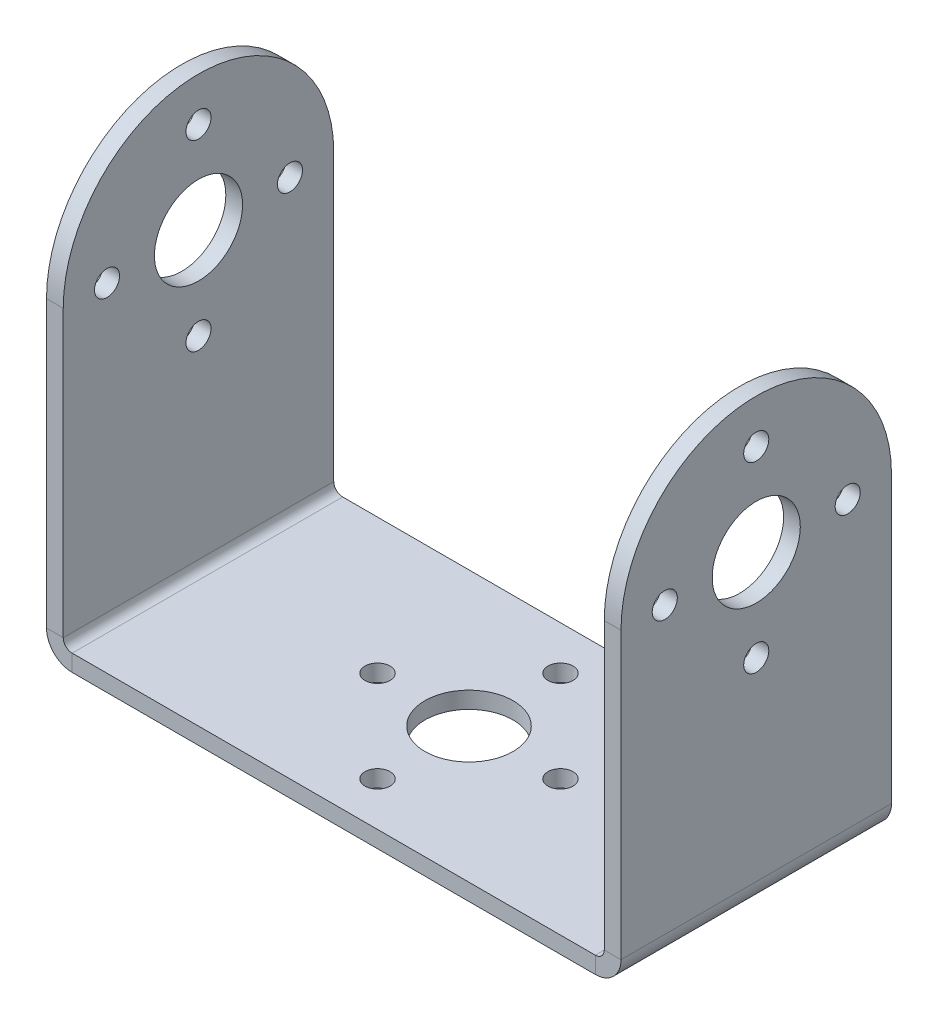
ISO-10303-21;
HEADER;
FILE_DESCRIPTION(('STEP AP214'),'2;1');
FILE_NAME('part.step','',(''),(''),'','','');
FILE_SCHEMA(('AUTOMOTIVE_DESIGN { 1 0 10303 214 1 1 1 1 }'));
ENDSEC;
DATA;
#1=APPLICATION_CONTEXT('core data for automotive mechanical design processes');
#2=APPLICATION_PROTOCOL_DEFINITION('international standard','automotive_design',2000,#1);
#3=PRODUCT_CONTEXT('',#1,'mechanical');
#4=PRODUCT('Part','Part','',(#3));
#5=PRODUCT_RELATED_PRODUCT_CATEGORY('part','',(#4));
#6=PRODUCT_DEFINITION_FORMATION('','',#4);
#7=PRODUCT_DEFINITION_CONTEXT('part definition',#1,'design');
#8=PRODUCT_DEFINITION('design','',#6,#7);
#9=PRODUCT_DEFINITION_SHAPE('','',#8);
#10=(LENGTH_UNIT() NAMED_UNIT(*) SI_UNIT(.MILLI.,.METRE.));
#11=(NAMED_UNIT(*) PLANE_ANGLE_UNIT() SI_UNIT($,.RADIAN.));
#12=(NAMED_UNIT(*) SI_UNIT($,.STERADIAN.) SOLID_ANGLE_UNIT());
#13=UNCERTAINTY_MEASURE_WITH_UNIT(LENGTH_MEASURE(1.E-05),#10,'distance_accuracy_value','');
#14=(GEOMETRIC_REPRESENTATION_CONTEXT(3) GLOBAL_UNCERTAINTY_ASSIGNED_CONTEXT((#13)) GLOBAL_UNIT_ASSIGNED_CONTEXT((#10,
#11,#12)) REPRESENTATION_CONTEXT('',''));
#15=CARTESIAN_POINT('',(0.,0.,0.));
#16=DIRECTION('',(0.,0.,1.));
#17=DIRECTION('',(1.,0.,0.));
#18=AXIS2_PLACEMENT_3D('',#15,#16,#17);
#19=CARTESIAN_POINT('',(26.162,28.321,0.));
#20=DIRECTION('',(1.,0.,0.));
#21=DIRECTION('',(0.,1.,0.));
#22=AXIS2_PLACEMENT_3D('',#19,#20,#21);
#23=CYLINDRICAL_SURFACE('',#22,12.319);
#24=DIRECTION('',(1.,0.,0.));
#25=VECTOR('',#24,1.);
#26=CARTESIAN_POINT('',(23.8251999999998,28.321,12.319));
#27=LINE('',#26,#25);
#28=CARTESIAN_POINT('',(26.162,28.321,12.319));
#29=VERTEX_POINT('',#28);
#30=CARTESIAN_POINT('',(24.638,28.321,12.319));
#31=VERTEX_POINT('',#30);
#32=EDGE_CURVE('E160',#29,#31,#27,.F.);
#33=ORIENTED_EDGE('',*,*,#32,.F.);
#34=CARTESIAN_POINT('',(26.162,28.321,0.));
#35=DIRECTION('',(-1.,0.,0.));
#36=DIRECTION('',(0.,0.,1.));
#37=AXIS2_PLACEMENT_3D('',#34,#35,#36);
#38=CIRCLE('',#37,12.319);
#39=CARTESIAN_POINT('',(26.162,28.321,-12.319));
#40=VERTEX_POINT('',#39);
#41=EDGE_CURVE('E50',#40,#29,#38,.F.);
#42=ORIENTED_EDGE('',*,*,#41,.F.);
#43=DIRECTION('',(1.,0.,0.));
#44=VECTOR('',#43,1.);
#45=CARTESIAN_POINT('',(23.8251999999998,28.321,-12.319));
#46=LINE('',#45,#44);
#47=CARTESIAN_POINT('',(24.638,28.321,-12.319));
#48=VERTEX_POINT('',#47);
#49=EDGE_CURVE('E292',#48,#40,#46,.T.);
#50=ORIENTED_EDGE('',*,*,#49,.F.);
#51=CARTESIAN_POINT('',(24.638,28.321,0.));
#52=DIRECTION('',(-1.,0.,0.));
#53=DIRECTION('',(0.,0.,1.));
#54=AXIS2_PLACEMENT_3D('',#51,#52,#53);
#55=CIRCLE('',#54,12.319);
#56=EDGE_CURVE('E11',#31,#48,#55,.T.);
#57=ORIENTED_EDGE('',*,*,#56,.F.);
#58=EDGE_LOOP('',(#33,#42,#50,#57));
#59=FACE_BOUND('',#58,.T.);
#60=ADVANCED_FACE('F42',(#59),#23,.T.);
#61=CARTESIAN_POINT('',(-24.638,28.321,0.));
#62=DIRECTION('',(1.,0.,0.));
#63=DIRECTION('',(0.,1.,0.));
#64=AXIS2_PLACEMENT_3D('',#61,#62,#63);
#65=CYLINDRICAL_SURFACE('',#64,12.319);
#66=DIRECTION('',(1.,0.,0.));
#67=VECTOR('',#66,1.);
#68=CARTESIAN_POINT('',(-23.8251999999998,28.321,12.319));
#69=LINE('',#68,#67);
#70=CARTESIAN_POINT('',(-24.638,28.321,12.319));
#71=VERTEX_POINT('',#70);
#72=CARTESIAN_POINT('',(-26.162,28.321,12.319));
#73=VERTEX_POINT('',#72);
#74=EDGE_CURVE('E276',#71,#73,#69,.F.);
#75=ORIENTED_EDGE('',*,*,#74,.F.);
#76=CARTESIAN_POINT('',(-24.638,28.321,0.));
#77=DIRECTION('',(1.,0.,0.));
#78=DIRECTION('',(0.,0.,-1.));
#79=AXIS2_PLACEMENT_3D('',#76,#77,#78);
#80=CIRCLE('',#79,12.319);
#81=CARTESIAN_POINT('',(-24.638,28.321,-12.319));
#82=VERTEX_POINT('',#81);
#83=EDGE_CURVE('E284',#82,#71,#80,.T.);
#84=ORIENTED_EDGE('',*,*,#83,.F.);
#85=DIRECTION('',(-1.,0.,0.));
#86=VECTOR('',#85,1.);
#87=CARTESIAN_POINT('',(-24.638,28.321,-12.319));
#88=LINE('',#87,#86);
#89=CARTESIAN_POINT('',(-26.162,28.321,-12.319));
#90=VERTEX_POINT('',#89);
#91=EDGE_CURVE('E280',#90,#82,#88,.F.);
#92=ORIENTED_EDGE('',*,*,#91,.F.);
#93=CARTESIAN_POINT('',(-26.162,28.321,0.));
#94=DIRECTION('',(1.,0.,0.));
#95=DIRECTION('',(0.,0.,-1.));
#96=AXIS2_PLACEMENT_3D('',#93,#94,#95);
#97=CIRCLE('',#96,12.319);
#98=EDGE_CURVE('E287',#73,#90,#97,.F.);
#99=ORIENTED_EDGE('',*,*,#98,.F.);
#100=EDGE_LOOP('',(#75,#84,#92,#99));
#101=FACE_BOUND('',#100,.T.);
#102=ADVANCED_FACE('F486',(#101),#65,.T.);
#103=CARTESIAN_POINT('',(-26.162,2.3368,12.319));
#104=DIRECTION('',(0.,0.,1.));
#105=DIRECTION('',(1.,0.,0.));
#106=AXIS2_PLACEMENT_3D('',#103,#104,#105);
#107=PLANE('',#106);
#108=DIRECTION('',(1.,0.,0.));
#109=VECTOR('',#108,1.);
#110=CARTESIAN_POINT('',(-26.162,2.3368,12.319));
#111=LINE('',#110,#109);
#112=CARTESIAN_POINT('',(-26.162,2.3368,12.319));
#113=VERTEX_POINT('',#112);
#114=CARTESIAN_POINT('',(-24.638,2.3368,12.319));
#115=VERTEX_POINT('',#114);
#116=EDGE_CURVE('E272',#113,#115,#111,.T.);
#117=ORIENTED_EDGE('',*,*,#116,.F.);
#118=CARTESIAN_POINT('',(-23.8252,2.3368,12.319));
#119=DIRECTION('',(0.,0.,-1.));
#120=DIRECTION('',(-1.,0.,0.));
#121=AXIS2_PLACEMENT_3D('',#118,#119,#120);
#122=CIRCLE('',#121,2.3368);
#123=CARTESIAN_POINT('',(-23.8252,0.,12.319));
#124=VERTEX_POINT('',#123);
#125=EDGE_CURVE('E184',#113,#124,#122,.F.);
#126=ORIENTED_EDGE('',*,*,#125,.T.);
#127=DIRECTION('',(0.,-1.,0.));
#128=VECTOR('',#127,1.);
#129=CARTESIAN_POINT('',(-23.8252,1.524,12.319));
#130=LINE('',#129,#128);
#131=CARTESIAN_POINT('',(-23.8252,1.524,12.319));
#132=VERTEX_POINT('',#131);
#133=EDGE_CURVE('E269',#132,#124,#130,.T.);
#134=ORIENTED_EDGE('',*,*,#133,.F.);
#135=CARTESIAN_POINT('',(-23.8252,2.3368,12.319));
#136=DIRECTION('',(0.,0.,1.));
#137=DIRECTION('',(1.,0.,0.));
#138=AXIS2_PLACEMENT_3D('',#135,#136,#137);
#139=CIRCLE('',#138,0.8128);
#140=EDGE_CURVE('E171',#115,#132,#139,.T.);
#141=ORIENTED_EDGE('',*,*,#140,.F.);
#142=EDGE_LOOP('',(#117,#126,#134,#141));
#143=FACE_BOUND('',#142,.T.);
#144=ADVANCED_FACE('F458',(#143),#107,.T.);
#145=CARTESIAN_POINT('',(-23.8252,1.524,12.319));
#146=DIRECTION('',(0.,0.,1.));
#147=DIRECTION('',(1.,0.,0.));
#148=AXIS2_PLACEMENT_3D('',#145,#146,#147);
#149=PLANE('',#148);
#150=DIRECTION('',(0.,1.,0.));
#151=VECTOR('',#150,1.);
#152=CARTESIAN_POINT('',(-24.638,0.,12.319));
#153=LINE('',#152,#151);
#154=EDGE_CURVE('E178',#71,#115,#153,.F.);
#155=ORIENTED_EDGE('',*,*,#154,.F.);
#156=ORIENTED_EDGE('',*,*,#74,.T.);
#157=DIRECTION('',(0.,-1.,0.));
#158=VECTOR('',#157,1.);
#159=CARTESIAN_POINT('',(-26.162,0.,12.319));
#160=LINE('',#159,#158);
#161=EDGE_CURVE('E181',#73,#113,#160,.T.);
#162=ORIENTED_EDGE('',*,*,#161,.T.);
#163=ORIENTED_EDGE('',*,*,#116,.T.);
#164=EDGE_LOOP('',(#155,#156,#162,#163));
#165=FACE_BOUND('',#164,.T.);
#166=ADVANCED_FACE('F483',(#165),#149,.T.);
#167=CARTESIAN_POINT('',(-23.8252,0.,-12.319));
#168=DIRECTION('',(0.,0.,-1.));
#169=DIRECTION('',(-1.,0.,0.));
#170=AXIS2_PLACEMENT_3D('',#167,#168,#169);
#171=PLANE('',#170);
#172=DIRECTION('',(0.,1.,0.));
#173=VECTOR('',#172,1.);
#174=CARTESIAN_POINT('',(-23.8252,0.,-12.319));
#175=LINE('',#174,#173);
#176=CARTESIAN_POINT('',(-23.8252,0.,-12.319));
#177=VERTEX_POINT('',#176);
#178=CARTESIAN_POINT('',(-23.8252,1.524,-12.319));
#179=VERTEX_POINT('',#178);
#180=EDGE_CURVE('E266',#177,#179,#175,.T.);
#181=ORIENTED_EDGE('',*,*,#180,.F.);
#182=CARTESIAN_POINT('',(-23.8252,2.3368,-12.319));
#183=DIRECTION('',(0.,0.,-1.));
#184=DIRECTION('',(-1.,0.,0.));
#185=AXIS2_PLACEMENT_3D('',#182,#183,#184);
#186=CIRCLE('',#185,2.3368);
#187=CARTESIAN_POINT('',(-26.162,2.3368,-12.319));
#188=VERTEX_POINT('',#187);
#189=EDGE_CURVE('E219',#188,#177,#186,.F.);
#190=ORIENTED_EDGE('',*,*,#189,.F.);
#191=DIRECTION('',(-1.,0.,0.));
#192=VECTOR('',#191,1.);
#193=CARTESIAN_POINT('',(-24.638,2.3368,-12.319));
#194=LINE('',#193,#192);
#195=CARTESIAN_POINT('',(-24.638,2.3368,-12.319));
#196=VERTEX_POINT('',#195);
#197=EDGE_CURVE('E262',#196,#188,#194,.T.);
#198=ORIENTED_EDGE('',*,*,#197,.F.);
#199=CARTESIAN_POINT('',(-23.8252,2.3368,-12.319));
#200=DIRECTION('',(0.,0.,1.));
#201=DIRECTION('',(1.,0.,0.));
#202=AXIS2_PLACEMENT_3D('',#199,#200,#201);
#203=CIRCLE('',#202,0.8128);
#204=EDGE_CURVE('E209',#196,#179,#203,.T.);
#205=ORIENTED_EDGE('',*,*,#204,.T.);
#206=EDGE_LOOP('',(#181,#190,#198,#205));
#207=FACE_BOUND('',#206,.T.);
#208=ADVANCED_FACE('F451',(#207),#171,.T.);
#209=CARTESIAN_POINT('',(-24.638,2.3368,-12.319));
#210=DIRECTION('',(0.,0.,-1.));
#211=DIRECTION('',(-1.,0.,0.));
#212=AXIS2_PLACEMENT_3D('',#209,#210,#211);
#213=PLANE('',#212);
#214=DIRECTION('',(1.,0.,0.));
#215=VECTOR('',#214,1.);
#216=CARTESIAN_POINT('',(-26.162,0.,-12.319));
#217=LINE('',#216,#215);
#218=CARTESIAN_POINT('',(23.8252,0.,-12.319));
#219=VERTEX_POINT('',#218);
#220=EDGE_CURVE('E223',#177,#219,#217,.T.);
#221=ORIENTED_EDGE('',*,*,#220,.F.);
#222=ORIENTED_EDGE('',*,*,#180,.T.);
#223=DIRECTION('',(1.,0.,0.));
#224=VECTOR('',#223,1.);
#225=CARTESIAN_POINT('',(-26.162,1.524,-12.319));
#226=LINE('',#225,#224);
#227=CARTESIAN_POINT('',(23.8252,1.524,-12.319));
#228=VERTEX_POINT('',#227);
#229=EDGE_CURVE('E205',#179,#228,#226,.T.);
#230=ORIENTED_EDGE('',*,*,#229,.T.);
#231=DIRECTION('',(0.,-1.,0.));
#232=VECTOR('',#231,1.);
#233=CARTESIAN_POINT('',(23.8252,1.524,-12.319));
#234=LINE('',#233,#232);
#235=EDGE_CURVE('E155',#228,#219,#234,.T.);
#236=ORIENTED_EDGE('',*,*,#235,.T.);
#237=EDGE_LOOP('',(#221,#222,#230,#236));
#238=FACE_BOUND('',#237,.T.);
#239=ADVANCED_FACE('F475',(#238),#213,.T.);
#240=CARTESIAN_POINT('',(23.8252,0.,12.319));
#241=DIRECTION('',(0.,0.,1.));
#242=DIRECTION('',(1.,0.,0.));
#243=AXIS2_PLACEMENT_3D('',#240,#241,#242);
#244=PLANE('',#243);
#245=DIRECTION('',(0.,1.,0.));
#246=VECTOR('',#245,1.);
#247=CARTESIAN_POINT('',(23.8252,0.,12.319));
#248=LINE('',#247,#246);
#249=CARTESIAN_POINT('',(23.8252,0.,12.319));
#250=VERTEX_POINT('',#249);
#251=CARTESIAN_POINT('',(23.8252,1.524,12.319));
#252=VERTEX_POINT('',#251);
#253=EDGE_CURVE('E142',#250,#252,#248,.T.);
#254=ORIENTED_EDGE('',*,*,#253,.F.);
#255=CARTESIAN_POINT('',(23.8252,2.3368,12.319));
#256=DIRECTION('',(0.,0.,-1.));
#257=DIRECTION('',(-1.,0.,0.));
#258=AXIS2_PLACEMENT_3D('',#255,#256,#257);
#259=CIRCLE('',#258,2.3368);
#260=CARTESIAN_POINT('',(26.162,2.3368,12.319));
#261=VERTEX_POINT('',#260);
#262=EDGE_CURVE('E136',#250,#261,#259,.F.);
#263=ORIENTED_EDGE('',*,*,#262,.T.);
#264=DIRECTION('',(1.,0.,0.));
#265=VECTOR('',#264,1.);
#266=CARTESIAN_POINT('',(24.638,2.3368,12.319));
#267=LINE('',#266,#265);
#268=CARTESIAN_POINT('',(24.638,2.3368,12.319));
#269=VERTEX_POINT('',#268);
#270=EDGE_CURVE('E129',#269,#261,#267,.T.);
#271=ORIENTED_EDGE('',*,*,#270,.F.);
#272=CARTESIAN_POINT('',(23.8252,2.3368,12.319));
#273=DIRECTION('',(0.,0.,1.));
#274=DIRECTION('',(1.,0.,0.));
#275=AXIS2_PLACEMENT_3D('',#272,#273,#274);
#276=CIRCLE('',#275,0.8128);
#277=EDGE_CURVE('E133',#252,#269,#276,.T.);
#278=ORIENTED_EDGE('',*,*,#277,.F.);
#279=EDGE_LOOP('',(#254,#263,#271,#278));
#280=FACE_BOUND('',#279,.T.);
#281=ADVANCED_FACE('F131',(#280),#244,.T.);
#282=CARTESIAN_POINT('',(24.638,2.3368,12.319));
#283=DIRECTION('',(0.,0.,1.));
#284=DIRECTION('',(1.,0.,0.));
#285=AXIS2_PLACEMENT_3D('',#282,#283,#284);
#286=PLANE('',#285);
#287=DIRECTION('',(1.,0.,0.));
#288=VECTOR('',#287,1.);
#289=CARTESIAN_POINT('',(-26.162,0.,12.319));
#290=LINE('',#289,#288);
#291=EDGE_CURVE('E188',#124,#250,#290,.T.);
#292=ORIENTED_EDGE('',*,*,#291,.T.);
#293=ORIENTED_EDGE('',*,*,#253,.T.);
#294=DIRECTION('',(1.,0.,0.));
#295=VECTOR('',#294,1.);
#296=CARTESIAN_POINT('',(-26.162,1.524,12.319));
#297=LINE('',#296,#295);
#298=EDGE_CURVE('E168',#132,#252,#297,.T.);
#299=ORIENTED_EDGE('',*,*,#298,.F.);
#300=ORIENTED_EDGE('',*,*,#133,.T.);
#301=EDGE_LOOP('',(#292,#293,#299,#300));
#302=FACE_BOUND('',#301,.T.);
#303=ADVANCED_FACE('F463',(#302),#286,.T.);
#304=CARTESIAN_POINT('',(26.162,2.3368,-12.319));
#305=DIRECTION('',(0.,0.,-1.));
#306=DIRECTION('',(-1.,0.,0.));
#307=AXIS2_PLACEMENT_3D('',#304,#305,#306);
#308=PLANE('',#307);
#309=DIRECTION('',(-1.,0.,0.));
#310=VECTOR('',#309,1.);
#311=CARTESIAN_POINT('',(26.162,2.3368,-12.319));
#312=LINE('',#311,#310);
#313=CARTESIAN_POINT('',(26.162,2.3368,-12.319));
#314=VERTEX_POINT('',#313);
#315=CARTESIAN_POINT('',(24.638,2.3368,-12.319));
#316=VERTEX_POINT('',#315);
#317=EDGE_CURVE('E143',#314,#316,#312,.T.);
#318=ORIENTED_EDGE('',*,*,#317,.F.);
#319=CARTESIAN_POINT('',(23.8252,2.3368,-12.319));
#320=DIRECTION('',(0.,0.,-1.));
#321=DIRECTION('',(-1.,0.,0.));
#322=AXIS2_PLACEMENT_3D('',#319,#320,#321);
#323=CIRCLE('',#322,2.3368);
#324=EDGE_CURVE('E227',#219,#314,#323,.F.);
#325=ORIENTED_EDGE('',*,*,#324,.F.);
#326=ORIENTED_EDGE('',*,*,#235,.F.);
#327=CARTESIAN_POINT('',(23.8252,2.3368,-12.319));
#328=DIRECTION('',(0.,0.,1.));
#329=DIRECTION('',(1.,0.,0.));
#330=AXIS2_PLACEMENT_3D('',#327,#328,#329);
#331=CIRCLE('',#330,0.8128);
#332=EDGE_CURVE('E202',#228,#316,#331,.T.);
#333=ORIENTED_EDGE('',*,*,#332,.T.);
#334=EDGE_LOOP('',(#318,#325,#326,#333));
#335=FACE_BOUND('',#334,.T.);
#336=ADVANCED_FACE('F474',(#335),#308,.T.);
#337=CARTESIAN_POINT('',(23.8252,1.524,-12.319));
#338=DIRECTION('',(0.,0.,-1.));
#339=DIRECTION('',(-1.,0.,0.));
#340=AXIS2_PLACEMENT_3D('',#337,#338,#339);
#341=PLANE('',#340);
#342=DIRECTION('',(0.,1.,0.));
#343=VECTOR('',#342,1.);
#344=CARTESIAN_POINT('',(24.638,0.,-12.319));
#345=LINE('',#344,#343);
#346=EDGE_CURVE('E150',#316,#48,#345,.T.);
#347=ORIENTED_EDGE('',*,*,#346,.T.);
#348=ORIENTED_EDGE('',*,*,#49,.T.);
#349=DIRECTION('',(0.,1.,0.));
#350=VECTOR('',#349,1.);
#351=CARTESIAN_POINT('',(26.162,0.,-12.319));
#352=LINE('',#351,#350);
#353=EDGE_CURVE('E195',#314,#40,#352,.T.);
#354=ORIENTED_EDGE('',*,*,#353,.F.);
#355=ORIENTED_EDGE('',*,*,#317,.T.);
#356=EDGE_LOOP('',(#347,#348,#354,#355));
#357=FACE_BOUND('',#356,.T.);
#358=ADVANCED_FACE('F472',(#357),#341,.T.);
#359=CARTESIAN_POINT('',(26.162,0.,12.319));
#360=DIRECTION('',(-1.,0.,0.));
#361=DIRECTION('',(0.,0.,1.));
#362=AXIS2_PLACEMENT_3D('',#359,#360,#361);
#363=PLANE('',#362);
#364=CARTESIAN_POINT('',(26.162,28.321,8.3312));
#365=DIRECTION('',(1.,0.,0.));
#366=DIRECTION('',(0.,0.,-1.));
#367=AXIS2_PLACEMENT_3D('',#364,#365,#366);
#368=CIRCLE('',#367,1.143);
#369=CARTESIAN_POINT('',(26.162,28.321,7.1882));
#370=VERTEX_POINT('',#369);
#371=EDGE_CURVE('E373',#370,#370,#368,.T.);
#372=ORIENTED_EDGE('',*,*,#371,.F.);
#373=EDGE_LOOP('',(#372));
#374=FACE_BOUND('',#373,.T.);
#375=CARTESIAN_POINT('',(26.162,19.9898,0.));
#376=DIRECTION('',(1.,0.,0.));
#377=DIRECTION('',(0.,0.,-1.));
#378=AXIS2_PLACEMENT_3D('',#375,#376,#377);
#379=CIRCLE('',#378,1.143);
#380=CARTESIAN_POINT('',(26.162,19.9898,-1.143));
#381=VERTEX_POINT('',#380);
#382=EDGE_CURVE('E357',#381,#381,#379,.T.);
#383=ORIENTED_EDGE('',*,*,#382,.F.);
#384=EDGE_LOOP('',(#383));
#385=FACE_BOUND('',#384,.T.);
#386=CARTESIAN_POINT('',(26.162,28.321,-8.3312));
#387=DIRECTION('',(1.,0.,0.));
#388=DIRECTION('',(0.,0.,-1.));
#389=AXIS2_PLACEMENT_3D('',#386,#387,#388);
#390=CIRCLE('',#389,1.143);
#391=CARTESIAN_POINT('',(26.162,28.321,-9.4742));
#392=VERTEX_POINT('',#391);
#393=EDGE_CURVE('E341',#392,#392,#390,.T.);
#394=ORIENTED_EDGE('',*,*,#393,.F.);
#395=EDGE_LOOP('',(#394));
#396=FACE_BOUND('',#395,.T.);
#397=CARTESIAN_POINT('',(26.162,36.6522,0.));
#398=DIRECTION('',(1.,0.,0.));
#399=DIRECTION('',(0.,0.,-1.));
#400=AXIS2_PLACEMENT_3D('',#397,#398,#399);
#401=CIRCLE('',#400,1.143);
#402=CARTESIAN_POINT('',(26.162,36.6522,-1.143));
#403=VERTEX_POINT('',#402);
#404=EDGE_CURVE('E325',#403,#403,#401,.T.);
#405=ORIENTED_EDGE('',*,*,#404,.F.);
#406=EDGE_LOOP('',(#405));
#407=FACE_BOUND('',#406,.T.);
#408=CARTESIAN_POINT('',(26.162,28.321,0.));
#409=DIRECTION('',(1.,0.,0.));
#410=DIRECTION('',(0.,0.,-1.));
#411=AXIS2_PLACEMENT_3D('',#408,#409,#410);
#412=CIRCLE('',#411,4.0132);
#413=CARTESIAN_POINT('',(26.162,28.321,-4.0132));
#414=VERTEX_POINT('',#413);
#415=EDGE_CURVE('E309',#414,#414,#412,.T.);
#416=ORIENTED_EDGE('',*,*,#415,.F.);
#417=EDGE_LOOP('',(#416));
#418=FACE_BOUND('',#417,.T.);
#419=ORIENTED_EDGE('',*,*,#353,.T.);
#420=ORIENTED_EDGE('',*,*,#41,.T.);
#421=DIRECTION('',(0.,1.,0.));
#422=VECTOR('',#421,1.);
#423=CARTESIAN_POINT('',(26.162,0.,12.319));
#424=LINE('',#423,#422);
#425=EDGE_CURVE('E162',#261,#29,#424,.T.);
#426=ORIENTED_EDGE('',*,*,#425,.F.);
#427=DIRECTION('',(0.,0.,-1.));
#428=VECTOR('',#427,1.);
#429=CARTESIAN_POINT('',(26.162,2.3368,12.319));
#430=LINE('',#429,#428);
#431=EDGE_CURVE('E194',#261,#314,#430,.T.);
#432=ORIENTED_EDGE('',*,*,#431,.T.);
#433=EDGE_LOOP('',(#419,#420,#426,#432));
#434=FACE_BOUND('',#433,.T.);
#435=ADVANCED_FACE('F297',(#374,#385,#396,#407,#418,#434),#363,.F.);
#436=CARTESIAN_POINT('',(24.638,0.,12.319));
#437=DIRECTION('',(-1.,0.,0.));
#438=DIRECTION('',(0.,0.,1.));
#439=AXIS2_PLACEMENT_3D('',#436,#437,#438);
#440=PLANE('',#439);
#441=CARTESIAN_POINT('',(24.638,28.321,8.3312));
#442=DIRECTION('',(-1.,0.,0.));
#443=DIRECTION('',(0.,0.,1.));
#444=AXIS2_PLACEMENT_3D('',#441,#442,#443);
#445=CIRCLE('',#444,1.143);
#446=CARTESIAN_POINT('',(24.638,28.321,9.4742));
#447=VERTEX_POINT('',#446);
#448=EDGE_CURVE('E361',#447,#447,#445,.T.);
#449=ORIENTED_EDGE('',*,*,#448,.F.);
#450=EDGE_LOOP('',(#449));
#451=FACE_BOUND('',#450,.T.);
#452=CARTESIAN_POINT('',(24.638,19.9898,0.));
#453=DIRECTION('',(-1.,0.,0.));
#454=DIRECTION('',(0.,0.,1.));
#455=AXIS2_PLACEMENT_3D('',#452,#453,#454);
#456=CIRCLE('',#455,1.143);
#457=CARTESIAN_POINT('',(24.638,19.9898,1.143));
#458=VERTEX_POINT('',#457);
#459=EDGE_CURVE('E345',#458,#458,#456,.T.);
#460=ORIENTED_EDGE('',*,*,#459,.F.);
#461=EDGE_LOOP('',(#460));
#462=FACE_BOUND('',#461,.T.);
#463=CARTESIAN_POINT('',(24.638,28.321,-8.3312));
#464=DIRECTION('',(-1.,0.,0.));
#465=DIRECTION('',(0.,0.,1.));
#466=AXIS2_PLACEMENT_3D('',#463,#464,#465);
#467=CIRCLE('',#466,1.143);
#468=CARTESIAN_POINT('',(24.638,28.321,-7.1882));
#469=VERTEX_POINT('',#468);
#470=EDGE_CURVE('E329',#469,#469,#467,.T.);
#471=ORIENTED_EDGE('',*,*,#470,.F.);
#472=EDGE_LOOP('',(#471));
#473=FACE_BOUND('',#472,.T.);
#474=CARTESIAN_POINT('',(24.638,36.6522,0.));
#475=DIRECTION('',(-1.,0.,0.));
#476=DIRECTION('',(0.,0.,1.));
#477=AXIS2_PLACEMENT_3D('',#474,#475,#476);
#478=CIRCLE('',#477,1.143);
#479=CARTESIAN_POINT('',(24.638,36.6522,1.143));
#480=VERTEX_POINT('',#479);
#481=EDGE_CURVE('E313',#480,#480,#478,.T.);
#482=ORIENTED_EDGE('',*,*,#481,.F.);
#483=EDGE_LOOP('',(#482));
#484=FACE_BOUND('',#483,.T.);
#485=CARTESIAN_POINT('',(24.638,28.321,0.));
#486=DIRECTION('',(-1.,0.,0.));
#487=DIRECTION('',(0.,0.,1.));
#488=AXIS2_PLACEMENT_3D('',#485,#486,#487);
#489=CIRCLE('',#488,4.0132);
#490=CARTESIAN_POINT('',(24.638,28.321,4.0132));
#491=VERTEX_POINT('',#490);
#492=EDGE_CURVE('E199',#491,#491,#489,.T.);
#493=ORIENTED_EDGE('',*,*,#492,.F.);
#494=EDGE_LOOP('',(#493));
#495=FACE_BOUND('',#494,.T.);
#496=DIRECTION('',(0.,1.,0.));
#497=VECTOR('',#496,1.);
#498=CARTESIAN_POINT('',(24.638,0.,12.319));
#499=LINE('',#498,#497);
#500=EDGE_CURVE('E148',#269,#31,#499,.T.);
#501=ORIENTED_EDGE('',*,*,#500,.T.);
#502=ORIENTED_EDGE('',*,*,#56,.T.);
#503=ORIENTED_EDGE('',*,*,#346,.F.);
#504=DIRECTION('',(0.,0.,-1.));
#505=VECTOR('',#504,1.);
#506=CARTESIAN_POINT('',(24.638,2.3368,12.319));
#507=LINE('',#506,#505);
#508=EDGE_CURVE('E146',#269,#316,#507,.T.);
#509=ORIENTED_EDGE('',*,*,#508,.F.);
#510=EDGE_LOOP('',(#501,#502,#503,#509));
#511=FACE_BOUND('',#510,.T.);
#512=ADVANCED_FACE('F147',(#451,#462,#473,#484,#495,#511),#440,.T.);
#513=CARTESIAN_POINT('',(23.8252,2.3368,12.319));
#514=DIRECTION('',(0.,0.,-1.));
#515=DIRECTION('',(-1.,0.,0.));
#516=AXIS2_PLACEMENT_3D('',#513,#514,#515);
#517=CYLINDRICAL_SURFACE('',#516,0.8128);
#518=ORIENTED_EDGE('',*,*,#332,.F.);
#519=DIRECTION('',(0.,0.,-1.));
#520=VECTOR('',#519,1.);
#521=CARTESIAN_POINT('',(23.8252,1.524,12.319));
#522=LINE('',#521,#520);
#523=EDGE_CURVE('E156',#252,#228,#522,.T.);
#524=ORIENTED_EDGE('',*,*,#523,.F.);
#525=ORIENTED_EDGE('',*,*,#277,.T.);
#526=ORIENTED_EDGE('',*,*,#508,.T.);
#527=EDGE_LOOP('',(#518,#524,#525,#526));
#528=FACE_BOUND('',#527,.T.);
#529=ADVANCED_FACE('F165',(#528),#517,.F.);
#530=CARTESIAN_POINT('',(-26.162,1.524,12.319));
#531=DIRECTION('',(0.,1.,0.));
#532=DIRECTION('',(0.,0.,1.));
#533=AXIS2_PLACEMENT_3D('',#530,#531,#532);
#534=PLANE('',#533);
#535=CARTESIAN_POINT('',(-8.3312,1.524,0.));
#536=DIRECTION('',(0.,1.,0.));
#537=DIRECTION('',(0.,0.,1.));
#538=AXIS2_PLACEMENT_3D('',#535,#536,#537);
#539=CIRCLE('',#538,1.143);
#540=CARTESIAN_POINT('',(-8.3312,1.524,1.14299999999999));
#541=VERTEX_POINT('',#540);
#542=EDGE_CURVE('E413',#541,#541,#539,.T.);
#543=ORIENTED_EDGE('',*,*,#542,.F.);
#544=EDGE_LOOP('',(#543));
#545=FACE_BOUND('',#544,.T.);
#546=CARTESIAN_POINT('',(0.,1.524,8.3312));
#547=DIRECTION('',(0.,1.,0.));
#548=DIRECTION('',(0.,0.,1.));
#549=AXIS2_PLACEMENT_3D('',#546,#547,#548);
#550=CIRCLE('',#549,1.143);
#551=CARTESIAN_POINT('',(0.,1.524,9.4742));
#552=VERTEX_POINT('',#551);
#553=EDGE_CURVE('E405',#552,#552,#550,.T.);
#554=ORIENTED_EDGE('',*,*,#553,.F.);
#555=EDGE_LOOP('',(#554));
#556=FACE_BOUND('',#555,.T.);
#557=CARTESIAN_POINT('',(8.3312,1.524,0.));
#558=DIRECTION('',(0.,1.,0.));
#559=DIRECTION('',(0.,0.,1.));
#560=AXIS2_PLACEMENT_3D('',#557,#558,#559);
#561=CIRCLE('',#560,1.143);
#562=CARTESIAN_POINT('',(8.3312,1.524,1.143));
#563=VERTEX_POINT('',#562);
#564=EDGE_CURVE('E397',#563,#563,#561,.T.);
#565=ORIENTED_EDGE('',*,*,#564,.F.);
#566=EDGE_LOOP('',(#565));
#567=FACE_BOUND('',#566,.T.);
#568=CARTESIAN_POINT('',(0.,1.524,-8.3312));
#569=DIRECTION('',(0.,1.,0.));
#570=DIRECTION('',(0.,0.,1.));
#571=AXIS2_PLACEMENT_3D('',#568,#569,#570);
#572=CIRCLE('',#571,1.143);
#573=CARTESIAN_POINT('',(0.,1.524,-7.1882));
#574=VERTEX_POINT('',#573);
#575=EDGE_CURVE('E389',#574,#574,#572,.T.);
#576=ORIENTED_EDGE('',*,*,#575,.F.);
#577=EDGE_LOOP('',(#576));
#578=FACE_BOUND('',#577,.T.);
#579=CARTESIAN_POINT('',(0.,1.524,0.));
#580=DIRECTION('',(0.,1.,0.));
#581=DIRECTION('',(0.,0.,1.));
#582=AXIS2_PLACEMENT_3D('',#579,#580,#581);
#583=CIRCLE('',#582,4.0132);
#584=CARTESIAN_POINT('',(0.,1.524,4.0132));
#585=VERTEX_POINT('',#584);
#586=EDGE_CURVE('E381',#585,#585,#583,.T.);
#587=ORIENTED_EDGE('',*,*,#586,.F.);
#588=EDGE_LOOP('',(#587));
#589=FACE_BOUND('',#588,.T.);
#590=ORIENTED_EDGE('',*,*,#229,.F.);
#591=DIRECTION('',(0.,0.,-1.));
#592=VECTOR('',#591,1.);
#593=CARTESIAN_POINT('',(-23.8252,1.524,12.319));
#594=LINE('',#593,#592);
#595=EDGE_CURVE('E250',#132,#179,#594,.T.);
#596=ORIENTED_EDGE('',*,*,#595,.F.);
#597=ORIENTED_EDGE('',*,*,#298,.T.);
#598=ORIENTED_EDGE('',*,*,#523,.T.);
#599=EDGE_LOOP('',(#590,#596,#597,#598));
#600=FACE_BOUND('',#599,.T.);
#601=ADVANCED_FACE('F431',(#545,#556,#567,#578,#589,#600),#534,.T.);
#602=CARTESIAN_POINT('',(-23.8252,2.3368,12.319));
#603=DIRECTION('',(0.,0.,-1.));
#604=DIRECTION('',(-1.,0.,0.));
#605=AXIS2_PLACEMENT_3D('',#602,#603,#604);
#606=CYLINDRICAL_SURFACE('',#605,0.8128);
#607=ORIENTED_EDGE('',*,*,#204,.F.);
#608=DIRECTION('',(0.,0.,-1.));
#609=VECTOR('',#608,1.);
#610=CARTESIAN_POINT('',(-24.638,2.3368,12.319));
#611=LINE('',#610,#609);
#612=EDGE_CURVE('E246',#115,#196,#611,.T.);
#613=ORIENTED_EDGE('',*,*,#612,.F.);
#614=ORIENTED_EDGE('',*,*,#140,.T.);
#615=ORIENTED_EDGE('',*,*,#595,.T.);
#616=EDGE_LOOP('',(#607,#613,#614,#615));
#617=FACE_BOUND('',#616,.T.);
#618=ADVANCED_FACE('F434',(#617),#606,.F.);
#619=CARTESIAN_POINT('',(-24.638,0.,12.319));
#620=DIRECTION('',(1.,0.,0.));
#621=DIRECTION('',(0.,0.,-1.));
#622=AXIS2_PLACEMENT_3D('',#619,#620,#621);
#623=PLANE('',#622);
#624=CARTESIAN_POINT('',(-24.638,28.321,8.3312));
#625=DIRECTION('',(1.,0.,0.));
#626=DIRECTION('',(0.,0.,-1.));
#627=AXIS2_PLACEMENT_3D('',#624,#625,#626);
#628=CIRCLE('',#627,1.143);
#629=CARTESIAN_POINT('',(-24.638,28.321,7.1882));
#630=VERTEX_POINT('',#629);
#631=EDGE_CURVE('E368',#630,#630,#628,.T.);
#632=ORIENTED_EDGE('',*,*,#631,.F.);
#633=EDGE_LOOP('',(#632));
#634=FACE_BOUND('',#633,.T.);
#635=CARTESIAN_POINT('',(-24.638,19.9898,0.));
#636=DIRECTION('',(1.,0.,0.));
#637=DIRECTION('',(0.,0.,-1.));
#638=AXIS2_PLACEMENT_3D('',#635,#636,#637);
#639=CIRCLE('',#638,1.143);
#640=CARTESIAN_POINT('',(-24.638,19.9898,-1.143));
#641=VERTEX_POINT('',#640);
#642=EDGE_CURVE('E352',#641,#641,#639,.T.);
#643=ORIENTED_EDGE('',*,*,#642,.F.);
#644=EDGE_LOOP('',(#643));
#645=FACE_BOUND('',#644,.T.);
#646=CARTESIAN_POINT('',(-24.638,28.321,-8.3312));
#647=DIRECTION('',(1.,0.,0.));
#648=DIRECTION('',(0.,0.,-1.));
#649=AXIS2_PLACEMENT_3D('',#646,#647,#648);
#650=CIRCLE('',#649,1.143);
#651=CARTESIAN_POINT('',(-24.638,28.321,-9.4742));
#652=VERTEX_POINT('',#651);
#653=EDGE_CURVE('E336',#652,#652,#650,.T.);
#654=ORIENTED_EDGE('',*,*,#653,.F.);
#655=EDGE_LOOP('',(#654));
#656=FACE_BOUND('',#655,.T.);
#657=CARTESIAN_POINT('',(-24.638,36.6522,0.));
#658=DIRECTION('',(1.,0.,0.));
#659=DIRECTION('',(0.,0.,-1.));
#660=AXIS2_PLACEMENT_3D('',#657,#658,#659);
#661=CIRCLE('',#660,1.143);
#662=CARTESIAN_POINT('',(-24.638,36.6522,-1.143));
#663=VERTEX_POINT('',#662);
#664=EDGE_CURVE('E320',#663,#663,#661,.T.);
#665=ORIENTED_EDGE('',*,*,#664,.F.);
#666=EDGE_LOOP('',(#665));
#667=FACE_BOUND('',#666,.T.);
#668=CARTESIAN_POINT('',(-24.638,28.321,0.));
#669=DIRECTION('',(1.,0.,0.));
#670=DIRECTION('',(0.,0.,-1.));
#671=AXIS2_PLACEMENT_3D('',#668,#669,#670);
#672=CIRCLE('',#671,4.0132);
#673=CARTESIAN_POINT('',(-24.638,28.321,-4.0132));
#674=VERTEX_POINT('',#673);
#675=EDGE_CURVE('E304',#674,#674,#672,.T.);
#676=ORIENTED_EDGE('',*,*,#675,.F.);
#677=EDGE_LOOP('',(#676));
#678=FACE_BOUND('',#677,.T.);
#679=DIRECTION('',(0.,1.,0.));
#680=VECTOR('',#679,1.);
#681=CARTESIAN_POINT('',(-24.638,0.,-12.319));
#682=LINE('',#681,#680);
#683=EDGE_CURVE('E213',#82,#196,#682,.F.);
#684=ORIENTED_EDGE('',*,*,#683,.F.);
#685=ORIENTED_EDGE('',*,*,#83,.T.);
#686=ORIENTED_EDGE('',*,*,#154,.T.);
#687=ORIENTED_EDGE('',*,*,#612,.T.);
#688=EDGE_LOOP('',(#684,#685,#686,#687));
#689=FACE_BOUND('',#688,.T.);
#690=ADVANCED_FACE('F505',(#634,#645,#656,#667,#678,#689),#623,.T.);
#691=CARTESIAN_POINT('',(-26.162,0.,12.319));
#692=DIRECTION('',(1.,0.,0.));
#693=DIRECTION('',(0.,0.,-1.));
#694=AXIS2_PLACEMENT_3D('',#691,#692,#693);
#695=PLANE('',#694);
#696=CARTESIAN_POINT('',(-26.162,28.321,8.3312));
#697=DIRECTION('',(1.,0.,0.));
#698=DIRECTION('',(0.,0.,-1.));
#699=AXIS2_PLACEMENT_3D('',#696,#697,#698);
#700=CIRCLE('',#699,1.143);
#701=CARTESIAN_POINT('',(-26.162,28.321,7.1882));
#702=VERTEX_POINT('',#701);
#703=EDGE_CURVE('E372',#702,#702,#700,.T.);
#704=ORIENTED_EDGE('',*,*,#703,.T.);
#705=EDGE_LOOP('',(#704));
#706=FACE_BOUND('',#705,.T.);
#707=CARTESIAN_POINT('',(-26.162,19.9898,0.));
#708=DIRECTION('',(1.,0.,0.));
#709=DIRECTION('',(0.,0.,-1.));
#710=AXIS2_PLACEMENT_3D('',#707,#708,#709);
#711=CIRCLE('',#710,1.143);
#712=CARTESIAN_POINT('',(-26.162,19.9898,-1.143));
#713=VERTEX_POINT('',#712);
#714=EDGE_CURVE('E356',#713,#713,#711,.T.);
#715=ORIENTED_EDGE('',*,*,#714,.T.);
#716=EDGE_LOOP('',(#715));
#717=FACE_BOUND('',#716,.T.);
#718=CARTESIAN_POINT('',(-26.162,28.321,-8.3312));
#719=DIRECTION('',(1.,0.,0.));
#720=DIRECTION('',(0.,0.,-1.));
#721=AXIS2_PLACEMENT_3D('',#718,#719,#720);
#722=CIRCLE('',#721,1.143);
#723=CARTESIAN_POINT('',(-26.162,28.321,-9.4742));
#724=VERTEX_POINT('',#723);
#725=EDGE_CURVE('E340',#724,#724,#722,.T.);
#726=ORIENTED_EDGE('',*,*,#725,.T.);
#727=EDGE_LOOP('',(#726));
#728=FACE_BOUND('',#727,.T.);
#729=CARTESIAN_POINT('',(-26.162,36.6522,0.));
#730=DIRECTION('',(1.,0.,0.));
#731=DIRECTION('',(0.,0.,-1.));
#732=AXIS2_PLACEMENT_3D('',#729,#730,#731);
#733=CIRCLE('',#732,1.143);
#734=CARTESIAN_POINT('',(-26.162,36.6522,-1.143));
#735=VERTEX_POINT('',#734);
#736=EDGE_CURVE('E324',#735,#735,#733,.T.);
#737=ORIENTED_EDGE('',*,*,#736,.T.);
#738=EDGE_LOOP('',(#737));
#739=FACE_BOUND('',#738,.T.);
#740=CARTESIAN_POINT('',(-26.162,28.321,0.));
#741=DIRECTION('',(1.,0.,0.));
#742=DIRECTION('',(0.,0.,-1.));
#743=AXIS2_PLACEMENT_3D('',#740,#741,#742);
#744=CIRCLE('',#743,4.0132);
#745=CARTESIAN_POINT('',(-26.162,28.321,-4.0132));
#746=VERTEX_POINT('',#745);
#747=EDGE_CURVE('E308',#746,#746,#744,.T.);
#748=ORIENTED_EDGE('',*,*,#747,.T.);
#749=EDGE_LOOP('',(#748));
#750=FACE_BOUND('',#749,.T.);
#751=ORIENTED_EDGE('',*,*,#161,.F.);
#752=ORIENTED_EDGE('',*,*,#98,.T.);
#753=DIRECTION('',(0.,-1.,0.));
#754=VECTOR('',#753,1.);
#755=CARTESIAN_POINT('',(-26.162,0.,-12.319));
#756=LINE('',#755,#754);
#757=EDGE_CURVE('E216',#90,#188,#756,.T.);
#758=ORIENTED_EDGE('',*,*,#757,.T.);
#759=DIRECTION('',(0.,0.,-1.));
#760=VECTOR('',#759,1.);
#761=CARTESIAN_POINT('',(-26.162,2.3368,12.319));
#762=LINE('',#761,#760);
#763=EDGE_CURVE('E242',#113,#188,#762,.T.);
#764=ORIENTED_EDGE('',*,*,#763,.F.);
#765=EDGE_LOOP('',(#751,#752,#758,#764));
#766=FACE_BOUND('',#765,.T.);
#767=ADVANCED_FACE('F509',(#706,#717,#728,#739,#750,#766),#695,.F.);
#768=CARTESIAN_POINT('',(-23.8252,2.3368,12.319));
#769=DIRECTION('',(0.,0.,-1.));
#770=DIRECTION('',(-1.,0.,0.));
#771=AXIS2_PLACEMENT_3D('',#768,#769,#770);
#772=CYLINDRICAL_SURFACE('',#771,2.3368);
#773=ORIENTED_EDGE('',*,*,#189,.T.);
#774=DIRECTION('',(0.,0.,-1.));
#775=VECTOR('',#774,1.);
#776=CARTESIAN_POINT('',(-23.8252,0.,12.319));
#777=LINE('',#776,#775);
#778=EDGE_CURVE('E238',#124,#177,#777,.T.);
#779=ORIENTED_EDGE('',*,*,#778,.F.);
#780=ORIENTED_EDGE('',*,*,#125,.F.);
#781=ORIENTED_EDGE('',*,*,#763,.T.);
#782=EDGE_LOOP('',(#773,#779,#780,#781));
#783=FACE_BOUND('',#782,.T.);
#784=ADVANCED_FACE('F511',(#783),#772,.T.);
#785=CARTESIAN_POINT('',(-26.162,0.,12.319));
#786=DIRECTION('',(0.,1.,0.));
#787=DIRECTION('',(0.,0.,1.));
#788=AXIS2_PLACEMENT_3D('',#785,#786,#787);
#789=PLANE('',#788);
#790=CARTESIAN_POINT('',(-8.3312,0.,0.));
#791=DIRECTION('',(0.,1.,0.));
#792=DIRECTION('',(0.,0.,1.));
#793=AXIS2_PLACEMENT_3D('',#790,#791,#792);
#794=CIRCLE('',#793,1.143);
#795=CARTESIAN_POINT('',(-8.3312,0.,1.14299999999999));
#796=VERTEX_POINT('',#795);
#797=EDGE_CURVE('E409',#796,#796,#794,.T.);
#798=ORIENTED_EDGE('',*,*,#797,.T.);
#799=EDGE_LOOP('',(#798));
#800=FACE_BOUND('',#799,.T.);
#801=CARTESIAN_POINT('',(0.,0.,8.3312));
#802=DIRECTION('',(0.,1.,0.));
#803=DIRECTION('',(0.,0.,1.));
#804=AXIS2_PLACEMENT_3D('',#801,#802,#803);
#805=CIRCLE('',#804,1.143);
#806=CARTESIAN_POINT('',(0.,0.,9.4742));
#807=VERTEX_POINT('',#806);
#808=EDGE_CURVE('E401',#807,#807,#805,.T.);
#809=ORIENTED_EDGE('',*,*,#808,.T.);
#810=EDGE_LOOP('',(#809));
#811=FACE_BOUND('',#810,.T.);
#812=CARTESIAN_POINT('',(8.3312,0.,0.));
#813=DIRECTION('',(0.,1.,0.));
#814=DIRECTION('',(0.,0.,1.));
#815=AXIS2_PLACEMENT_3D('',#812,#813,#814);
#816=CIRCLE('',#815,1.143);
#817=CARTESIAN_POINT('',(8.3312,0.,1.143));
#818=VERTEX_POINT('',#817);
#819=EDGE_CURVE('E393',#818,#818,#816,.T.);
#820=ORIENTED_EDGE('',*,*,#819,.T.);
#821=EDGE_LOOP('',(#820));
#822=FACE_BOUND('',#821,.T.);
#823=CARTESIAN_POINT('',(0.,0.,-8.3312));
#824=DIRECTION('',(0.,1.,0.));
#825=DIRECTION('',(0.,0.,1.));
#826=AXIS2_PLACEMENT_3D('',#823,#824,#825);
#827=CIRCLE('',#826,1.143);
#828=CARTESIAN_POINT('',(0.,0.,-7.1882));
#829=VERTEX_POINT('',#828);
#830=EDGE_CURVE('E385',#829,#829,#827,.T.);
#831=ORIENTED_EDGE('',*,*,#830,.T.);
#832=EDGE_LOOP('',(#831));
#833=FACE_BOUND('',#832,.T.);
#834=CARTESIAN_POINT('',(0.,0.,0.));
#835=DIRECTION('',(0.,1.,0.));
#836=DIRECTION('',(0.,0.,1.));
#837=AXIS2_PLACEMENT_3D('',#834,#835,#836);
#838=CIRCLE('',#837,4.0132);
#839=CARTESIAN_POINT('',(0.,0.,4.0132));
#840=VERTEX_POINT('',#839);
#841=EDGE_CURVE('E377',#840,#840,#838,.T.);
#842=ORIENTED_EDGE('',*,*,#841,.T.);
#843=EDGE_LOOP('',(#842));
#844=FACE_BOUND('',#843,.T.);
#845=ORIENTED_EDGE('',*,*,#220,.T.);
#846=DIRECTION('',(0.,0.,-1.));
#847=VECTOR('',#846,1.);
#848=CARTESIAN_POINT('',(23.8252,0.,12.319));
#849=LINE('',#848,#847);
#850=EDGE_CURVE('E234',#250,#219,#849,.T.);
#851=ORIENTED_EDGE('',*,*,#850,.F.);
#852=ORIENTED_EDGE('',*,*,#291,.F.);
#853=ORIENTED_EDGE('',*,*,#778,.T.);
#854=EDGE_LOOP('',(#845,#851,#852,#853));
#855=FACE_BOUND('',#854,.T.);
#856=ADVANCED_FACE('F421',(#800,#811,#822,#833,#844,#855),#789,.F.);
#857=CARTESIAN_POINT('',(23.8252,2.3368,12.319));
#858=DIRECTION('',(0.,0.,-1.));
#859=DIRECTION('',(-1.,0.,0.));
#860=AXIS2_PLACEMENT_3D('',#857,#858,#859);
#861=CYLINDRICAL_SURFACE('',#860,2.3368);
#862=ORIENTED_EDGE('',*,*,#324,.T.);
#863=ORIENTED_EDGE('',*,*,#431,.F.);
#864=ORIENTED_EDGE('',*,*,#262,.F.);
#865=ORIENTED_EDGE('',*,*,#850,.T.);
#866=EDGE_LOOP('',(#862,#863,#864,#865));
#867=FACE_BOUND('',#866,.T.);
#868=ADVANCED_FACE('F470',(#867),#861,.T.);
#869=CARTESIAN_POINT('',(23.8252,2.3368,12.319));
#870=DIRECTION('',(0.,0.,1.));
#871=DIRECTION('',(1.,0.,0.));
#872=AXIS2_PLACEMENT_3D('',#869,#870,#871);
#873=PLANE('',#872);
#874=ORIENTED_EDGE('',*,*,#425,.T.);
#875=ORIENTED_EDGE('',*,*,#32,.T.);
#876=ORIENTED_EDGE('',*,*,#500,.F.);
#877=ORIENTED_EDGE('',*,*,#270,.T.);
#878=EDGE_LOOP('',(#874,#875,#876,#877));
#879=FACE_BOUND('',#878,.T.);
#880=ADVANCED_FACE('F159',(#879),#873,.T.);
#881=CARTESIAN_POINT('',(23.8252,2.3368,-12.319));
#882=DIRECTION('',(0.,0.,1.));
#883=DIRECTION('',(1.,0.,0.));
#884=AXIS2_PLACEMENT_3D('',#881,#882,#883);
#885=PLANE('',#884);
#886=ORIENTED_EDGE('',*,*,#757,.F.);
#887=ORIENTED_EDGE('',*,*,#91,.T.);
#888=ORIENTED_EDGE('',*,*,#683,.T.);
#889=ORIENTED_EDGE('',*,*,#197,.T.);
#890=EDGE_LOOP('',(#886,#887,#888,#889));
#891=FACE_BOUND('',#890,.T.);
#892=ADVANCED_FACE('F597',(#891),#885,.F.);
#893=CARTESIAN_POINT('',(-26.162,28.321,0.));
#894=DIRECTION('',(1.,0.,0.));
#895=DIRECTION('',(0.,0.,-1.));
#896=AXIS2_PLACEMENT_3D('',#893,#894,#895);
#897=CYLINDRICAL_SURFACE('',#896,4.0132);
#898=ORIENTED_EDGE('',*,*,#675,.T.);
#899=EDGE_LOOP('',(#898));
#900=FACE_BOUND('',#899,.T.);
#901=ORIENTED_EDGE('',*,*,#747,.F.);
#902=EDGE_LOOP('',(#901));
#903=FACE_BOUND('',#902,.T.);
#904=ADVANCED_FACE('F591',(#900,#903),#897,.F.);
#905=ORIENTED_EDGE('',*,*,#492,.T.);
#906=EDGE_LOOP('',(#905));
#907=FACE_BOUND('',#906,.T.);
#908=ORIENTED_EDGE('',*,*,#415,.T.);
#909=EDGE_LOOP('',(#908));
#910=FACE_BOUND('',#909,.T.);
#911=ADVANCED_FACE('F596',(#907,#910),#897,.F.);
#912=CARTESIAN_POINT('',(-26.162,36.6522,0.));
#913=DIRECTION('',(1.,0.,0.));
#914=DIRECTION('',(0.,0.,-1.));
#915=AXIS2_PLACEMENT_3D('',#912,#913,#914);
#916=CYLINDRICAL_SURFACE('',#915,1.143);
#917=ORIENTED_EDGE('',*,*,#664,.T.);
#918=EDGE_LOOP('',(#917));
#919=FACE_BOUND('',#918,.T.);
#920=ORIENTED_EDGE('',*,*,#736,.F.);
#921=EDGE_LOOP('',(#920));
#922=FACE_BOUND('',#921,.T.);
#923=ADVANCED_FACE('F609',(#919,#922),#916,.F.);
#924=ORIENTED_EDGE('',*,*,#481,.T.);
#925=EDGE_LOOP('',(#924));
#926=FACE_BOUND('',#925,.T.);
#927=ORIENTED_EDGE('',*,*,#404,.T.);
#928=EDGE_LOOP('',(#927));
#929=FACE_BOUND('',#928,.T.);
#930=ADVANCED_FACE('F618',(#926,#929),#916,.F.);
#931=CARTESIAN_POINT('',(-26.162,28.321,-8.3312));
#932=DIRECTION('',(1.,0.,0.));
#933=DIRECTION('',(0.,0.,-1.));
#934=AXIS2_PLACEMENT_3D('',#931,#932,#933);
#935=CYLINDRICAL_SURFACE('',#934,1.143);
#936=ORIENTED_EDGE('',*,*,#653,.T.);
#937=EDGE_LOOP('',(#936));
#938=FACE_BOUND('',#937,.T.);
#939=ORIENTED_EDGE('',*,*,#725,.F.);
#940=EDGE_LOOP('',(#939));
#941=FACE_BOUND('',#940,.T.);
#942=ADVANCED_FACE('F628',(#938,#941),#935,.F.);
#943=ORIENTED_EDGE('',*,*,#470,.T.);
#944=EDGE_LOOP('',(#943));
#945=FACE_BOUND('',#944,.T.);
#946=ORIENTED_EDGE('',*,*,#393,.T.);
#947=EDGE_LOOP('',(#946));
#948=FACE_BOUND('',#947,.T.);
#949=ADVANCED_FACE('F637',(#945,#948),#935,.F.);
#950=CARTESIAN_POINT('',(-26.162,19.9898,0.));
#951=DIRECTION('',(1.,0.,0.));
#952=DIRECTION('',(0.,0.,-1.));
#953=AXIS2_PLACEMENT_3D('',#950,#951,#952);
#954=CYLINDRICAL_SURFACE('',#953,1.143);
#955=ORIENTED_EDGE('',*,*,#642,.T.);
#956=EDGE_LOOP('',(#955));
#957=FACE_BOUND('',#956,.T.);
#958=ORIENTED_EDGE('',*,*,#714,.F.);
#959=EDGE_LOOP('',(#958));
#960=FACE_BOUND('',#959,.T.);
#961=ADVANCED_FACE('F647',(#957,#960),#954,.F.);
#962=ORIENTED_EDGE('',*,*,#459,.T.);
#963=EDGE_LOOP('',(#962));
#964=FACE_BOUND('',#963,.T.);
#965=ORIENTED_EDGE('',*,*,#382,.T.);
#966=EDGE_LOOP('',(#965));
#967=FACE_BOUND('',#966,.T.);
#968=ADVANCED_FACE('F656',(#964,#967),#954,.F.);
#969=CARTESIAN_POINT('',(-26.162,28.321,8.3312));
#970=DIRECTION('',(1.,0.,0.));
#971=DIRECTION('',(0.,0.,-1.));
#972=AXIS2_PLACEMENT_3D('',#969,#970,#971);
#973=CYLINDRICAL_SURFACE('',#972,1.143);
#974=ORIENTED_EDGE('',*,*,#631,.T.);
#975=EDGE_LOOP('',(#974));
#976=FACE_BOUND('',#975,.T.);
#977=ORIENTED_EDGE('',*,*,#703,.F.);
#978=EDGE_LOOP('',(#977));
#979=FACE_BOUND('',#978,.T.);
#980=ADVANCED_FACE('F666',(#976,#979),#973,.F.);
#981=ORIENTED_EDGE('',*,*,#448,.T.);
#982=EDGE_LOOP('',(#981));
#983=FACE_BOUND('',#982,.T.);
#984=ORIENTED_EDGE('',*,*,#371,.T.);
#985=EDGE_LOOP('',(#984));
#986=FACE_BOUND('',#985,.T.);
#987=ADVANCED_FACE('F674',(#983,#986),#973,.F.);
#988=CARTESIAN_POINT('',(0.,0.,0.));
#989=DIRECTION('',(0.,1.,0.));
#990=DIRECTION('',(0.,0.,1.));
#991=AXIS2_PLACEMENT_3D('',#988,#989,#990);
#992=CYLINDRICAL_SURFACE('',#991,4.0132);
#993=ORIENTED_EDGE('',*,*,#841,.F.);
#994=EDGE_LOOP('',(#993));
#995=FACE_BOUND('',#994,.T.);
#996=ORIENTED_EDGE('',*,*,#586,.T.);
#997=EDGE_LOOP('',(#996));
#998=FACE_BOUND('',#997,.T.);
#999=ADVANCED_FACE('F683',(#995,#998),#992,.F.);
#1000=CARTESIAN_POINT('',(0.,0.,-8.3312));
#1001=DIRECTION('',(0.,1.,0.));
#1002=DIRECTION('',(0.,0.,1.));
#1003=AXIS2_PLACEMENT_3D('',#1000,#1001,#1002);
#1004=CYLINDRICAL_SURFACE('',#1003,1.143);
#1005=ORIENTED_EDGE('',*,*,#830,.F.);
#1006=EDGE_LOOP('',(#1005));
#1007=FACE_BOUND('',#1006,.T.);
#1008=ORIENTED_EDGE('',*,*,#575,.T.);
#1009=EDGE_LOOP('',(#1008));
#1010=FACE_BOUND('',#1009,.T.);
#1011=ADVANCED_FACE('F693',(#1007,#1010),#1004,.F.);
#1012=CARTESIAN_POINT('',(8.3312,0.,0.));
#1013=DIRECTION('',(0.,1.,0.));
#1014=DIRECTION('',(0.,0.,1.));
#1015=AXIS2_PLACEMENT_3D('',#1012,#1013,#1014);
#1016=CYLINDRICAL_SURFACE('',#1015,1.143);
#1017=ORIENTED_EDGE('',*,*,#819,.F.);
#1018=EDGE_LOOP('',(#1017));
#1019=FACE_BOUND('',#1018,.T.);
#1020=ORIENTED_EDGE('',*,*,#564,.T.);
#1021=EDGE_LOOP('',(#1020));
#1022=FACE_BOUND('',#1021,.T.);
#1023=ADVANCED_FACE('F700',(#1019,#1022),#1016,.F.);
#1024=CARTESIAN_POINT('',(0.,0.,8.3312));
#1025=DIRECTION('',(0.,1.,0.));
#1026=DIRECTION('',(0.,0.,1.));
#1027=AXIS2_PLACEMENT_3D('',#1024,#1025,#1026);
#1028=CYLINDRICAL_SURFACE('',#1027,1.143);
#1029=ORIENTED_EDGE('',*,*,#808,.F.);
#1030=EDGE_LOOP('',(#1029));
#1031=FACE_BOUND('',#1030,.T.);
#1032=ORIENTED_EDGE('',*,*,#553,.T.);
#1033=EDGE_LOOP('',(#1032));
#1034=FACE_BOUND('',#1033,.T.);
#1035=ADVANCED_FACE('F427',(#1031,#1034),#1028,.F.);
#1036=CARTESIAN_POINT('',(-8.3312,0.,0.));
#1037=DIRECTION('',(0.,1.,0.));
#1038=DIRECTION('',(0.,0.,1.));
#1039=AXIS2_PLACEMENT_3D('',#1036,#1037,#1038);
#1040=CYLINDRICAL_SURFACE('',#1039,1.143);
#1041=ORIENTED_EDGE('',*,*,#797,.F.);
#1042=EDGE_LOOP('',(#1041));
#1043=FACE_BOUND('',#1042,.T.);
#1044=ORIENTED_EDGE('',*,*,#542,.T.);
#1045=EDGE_LOOP('',(#1044));
#1046=FACE_BOUND('',#1045,.T.);
#1047=ADVANCED_FACE('F424',(#1043,#1046),#1040,.F.);
#1048=CLOSED_SHELL('',(#60,#102,#144,#166,#208,#239,#281,#303,#336,#358,#435,#512,#529,#601,
#618,#690,#767,#784,#856,#868,#880,#892,#904,#911,#923,#930,#942,#949,#961,#968,#980,#987,#999,
#1011,#1023,#1035,#1047));
#1049=MANIFOLD_SOLID_BREP('B2',#1048);
#1050=ADVANCED_BREP_SHAPE_REPRESENTATION('',(#18,#1049),#14);
#1051=SHAPE_DEFINITION_REPRESENTATION(#9,#1050);
ENDSEC;
END-ISO-10303-21;
